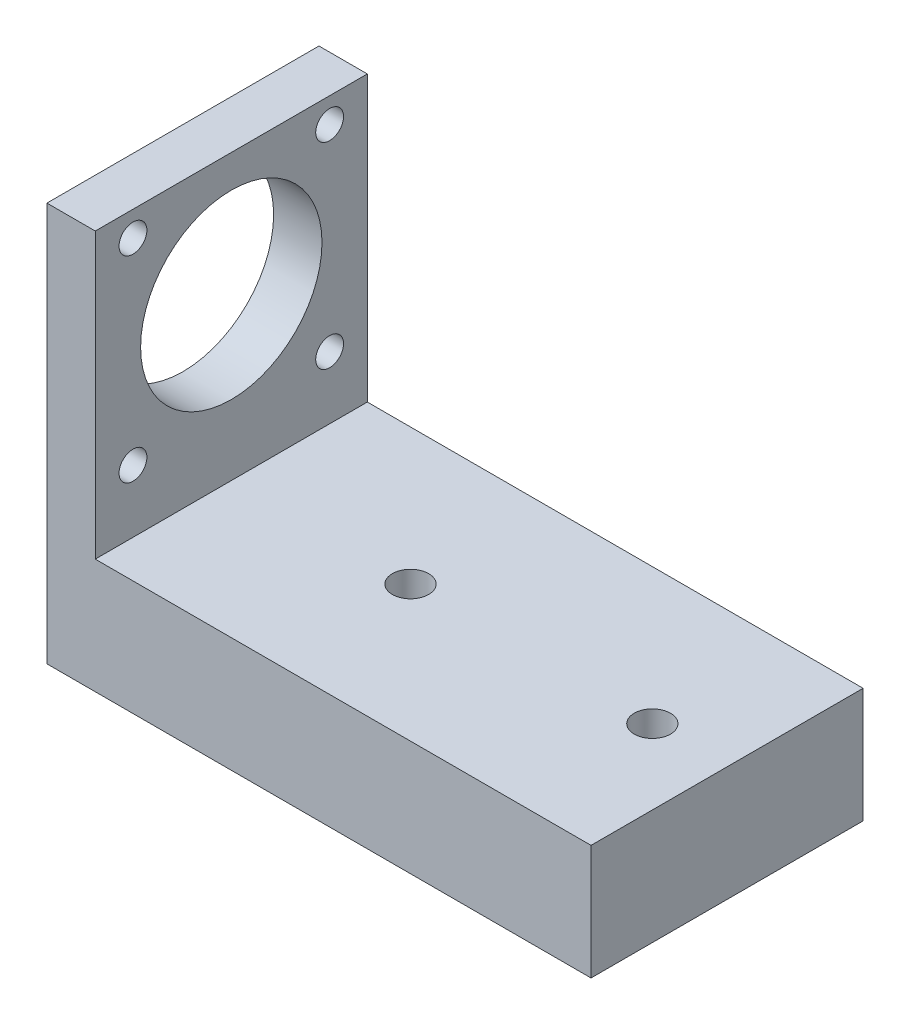
ISO-10303-21;
HEADER;
FILE_DESCRIPTION(('STEP AP214'),'2;1');
FILE_NAME('part.step','',(''),(''),'','','');
FILE_SCHEMA(('AUTOMOTIVE_DESIGN { 1 0 10303 214 1 1 1 1 }'));
ENDSEC;
DATA;
#1=APPLICATION_CONTEXT('core data for automotive mechanical design processes');
#2=APPLICATION_PROTOCOL_DEFINITION('international standard','automotive_design',2000,#1);
#3=PRODUCT_CONTEXT('',#1,'mechanical');
#4=PRODUCT('Part','Part','',(#3));
#5=PRODUCT_RELATED_PRODUCT_CATEGORY('part','',(#4));
#6=PRODUCT_DEFINITION_FORMATION('','',#4);
#7=PRODUCT_DEFINITION_CONTEXT('part definition',#1,'design');
#8=PRODUCT_DEFINITION('design','',#6,#7);
#9=PRODUCT_DEFINITION_SHAPE('','',#8);
#10=(LENGTH_UNIT() NAMED_UNIT(*) SI_UNIT(.MILLI.,.METRE.));
#11=(NAMED_UNIT(*) PLANE_ANGLE_UNIT() SI_UNIT($,.RADIAN.));
#12=(NAMED_UNIT(*) SI_UNIT($,.STERADIAN.) SOLID_ANGLE_UNIT());
#13=UNCERTAINTY_MEASURE_WITH_UNIT(LENGTH_MEASURE(1.E-05),#10,'distance_accuracy_value','');
#14=(GEOMETRIC_REPRESENTATION_CONTEXT(3) GLOBAL_UNCERTAINTY_ASSIGNED_CONTEXT((#13)) GLOBAL_UNIT_ASSIGNED_CONTEXT((#10,
#11,#12)) REPRESENTATION_CONTEXT('',''));
#15=CARTESIAN_POINT('',(0.,0.,0.));
#16=DIRECTION('',(0.,0.,1.));
#17=DIRECTION('',(1.,0.,0.));
#18=AXIS2_PLACEMENT_3D('',#15,#16,#17);
#19=CARTESIAN_POINT('',(-37.,66.,0.));
#20=DIRECTION('',(1.,0.,0.));
#21=DIRECTION('',(0.,0.,-1.));
#22=AXIS2_PLACEMENT_3D('',#19,#20,#21);
#23=PLANE('',#22);
#24=CARTESIAN_POINT('',(-37.,61.8634559672882,16.2634559672893));
#25=DIRECTION('',(1.,0.,0.));
#26=DIRECTION('',(0.,0.,-1.));
#27=AXIS2_PLACEMENT_3D('',#24,#25,#26);
#28=CIRCLE('',#27,2.3);
#29=CARTESIAN_POINT('',(-37.,61.8634559672882,13.9634559672893));
#30=VERTEX_POINT('',#29);
#31=EDGE_CURVE('E108',#30,#30,#28,.T.);
#32=ORIENTED_EDGE('',*,*,#31,.F.);
#33=EDGE_LOOP('',(#32));
#34=FACE_BOUND('',#33,.T.);
#35=CARTESIAN_POINT('',(-37.,29.336544032707,16.2634559672846));
#36=DIRECTION('',(1.,0.,0.));
#37=DIRECTION('',(0.,0.,-1.));
#38=AXIS2_PLACEMENT_3D('',#35,#36,#37);
#39=CIRCLE('',#38,2.3);
#40=CARTESIAN_POINT('',(-37.,29.336544032707,13.9634559672846));
#41=VERTEX_POINT('',#40);
#42=EDGE_CURVE('E158',#41,#41,#39,.T.);
#43=ORIENTED_EDGE('',*,*,#42,.F.);
#44=EDGE_LOOP('',(#43));
#45=FACE_BOUND('',#44,.T.);
#46=CARTESIAN_POINT('',(-37.,29.3365440327119,-16.2634559672967));
#47=DIRECTION('',(1.,0.,0.));
#48=DIRECTION('',(0.,0.,-1.));
#49=AXIS2_PLACEMENT_3D('',#46,#47,#48);
#50=CIRCLE('',#49,2.3);
#51=CARTESIAN_POINT('',(-37.,29.3365440327119,-18.5634559672966));
#52=VERTEX_POINT('',#51);
#53=EDGE_CURVE('E154',#52,#52,#50,.T.);
#54=ORIENTED_EDGE('',*,*,#53,.F.);
#55=EDGE_LOOP('',(#54));
#56=FACE_BOUND('',#55,.T.);
#57=CARTESIAN_POINT('',(-37.,61.8634559672931,-16.2634559672917));
#58=DIRECTION('',(1.,0.,0.));
#59=DIRECTION('',(0.,0.,-1.));
#60=AXIS2_PLACEMENT_3D('',#57,#58,#59);
#61=CIRCLE('',#60,2.3);
#62=CARTESIAN_POINT('',(-37.,61.8634559672931,-18.5634559672917));
#63=VERTEX_POINT('',#62);
#64=EDGE_CURVE('E150',#63,#63,#61,.T.);
#65=ORIENTED_EDGE('',*,*,#64,.F.);
#66=EDGE_LOOP('',(#65));
#67=FACE_BOUND('',#66,.T.);
#68=CARTESIAN_POINT('',(-37.,45.6,0.));
#69=DIRECTION('',(1.,0.,0.));
#70=DIRECTION('',(0.,0.,-1.));
#71=AXIS2_PLACEMENT_3D('',#68,#69,#70);
#72=CIRCLE('',#71,15.);
#73=CARTESIAN_POINT('',(-37.,45.6,-15.));
#74=VERTEX_POINT('',#73);
#75=EDGE_CURVE('E146',#74,#74,#72,.T.);
#76=ORIENTED_EDGE('',*,*,#75,.F.);
#77=EDGE_LOOP('',(#76));
#78=FACE_BOUND('',#77,.T.);
#79=DIRECTION('',(0.,-1.,0.));
#80=VECTOR('',#79,1.);
#81=CARTESIAN_POINT('',(-37.,66.,22.5));
#82=LINE('',#81,#80);
#83=CARTESIAN_POINT('',(-37.,66.,22.5));
#84=VERTEX_POINT('',#83);
#85=CARTESIAN_POINT('',(-37.,19.,22.5));
#86=VERTEX_POINT('',#85);
#87=EDGE_CURVE('E127',#84,#86,#82,.T.);
#88=ORIENTED_EDGE('',*,*,#87,.T.);
#89=DIRECTION('',(0.,0.,1.));
#90=VECTOR('',#89,1.);
#91=CARTESIAN_POINT('',(-37.,19.,-22.5));
#92=LINE('',#91,#90);
#93=CARTESIAN_POINT('',(-37.,19.,-22.5));
#94=VERTEX_POINT('',#93);
#95=EDGE_CURVE('E102',#94,#86,#92,.T.);
#96=ORIENTED_EDGE('',*,*,#95,.F.);
#97=DIRECTION('',(0.,-1.,0.));
#98=VECTOR('',#97,1.);
#99=CARTESIAN_POINT('',(-37.,66.,-22.5));
#100=LINE('',#99,#98);
#101=CARTESIAN_POINT('',(-37.,66.,-22.5));
#102=VERTEX_POINT('',#101);
#103=EDGE_CURVE('E101',#102,#94,#100,.T.);
#104=ORIENTED_EDGE('',*,*,#103,.F.);
#105=DIRECTION('',(0.,0.,1.));
#106=VECTOR('',#105,1.);
#107=CARTESIAN_POINT('',(-37.,66.,0.));
#108=LINE('',#107,#106);
#109=EDGE_CURVE('E117',#102,#84,#108,.T.);
#110=ORIENTED_EDGE('',*,*,#109,.T.);
#111=EDGE_LOOP('',(#88,#96,#104,#110));
#112=FACE_BOUND('',#111,.T.);
#113=ADVANCED_FACE('F37',(#34,#45,#56,#67,#78,#112),#23,.T.);
#114=CARTESIAN_POINT('',(45.,5.,-22.5));
#115=DIRECTION('',(-1.,0.,0.));
#116=DIRECTION('',(0.,0.,1.));
#117=AXIS2_PLACEMENT_3D('',#114,#115,#116);
#118=PLANE('',#117);
#119=DIRECTION('',(0.,0.,-1.));
#120=VECTOR('',#119,1.);
#121=CARTESIAN_POINT('',(45.,0.,-22.5));
#122=LINE('',#121,#120);
#123=CARTESIAN_POINT('',(45.,0.,22.5));
#124=VERTEX_POINT('',#123);
#125=CARTESIAN_POINT('',(45.,0.,-22.5));
#126=VERTEX_POINT('',#125);
#127=EDGE_CURVE('E96',#124,#126,#122,.T.);
#128=ORIENTED_EDGE('',*,*,#127,.T.);
#129=DIRECTION('',(0.,-1.,0.));
#130=VECTOR('',#129,1.);
#131=CARTESIAN_POINT('',(45.,5.,-22.5));
#132=LINE('',#131,#130);
#133=CARTESIAN_POINT('',(45.,19.,-22.5));
#134=VERTEX_POINT('',#133);
#135=EDGE_CURVE('E11',#134,#126,#132,.T.);
#136=ORIENTED_EDGE('',*,*,#135,.F.);
#137=DIRECTION('',(0.,0.,-1.));
#138=VECTOR('',#137,1.);
#139=CARTESIAN_POINT('',(45.,19.,-22.5));
#140=LINE('',#139,#138);
#141=CARTESIAN_POINT('',(45.,19.,22.5));
#142=VERTEX_POINT('',#141);
#143=EDGE_CURVE('E94',#142,#134,#140,.T.);
#144=ORIENTED_EDGE('',*,*,#143,.F.);
#145=DIRECTION('',(0.,-1.,0.));
#146=VECTOR('',#145,1.);
#147=CARTESIAN_POINT('',(45.,5.,22.5));
#148=LINE('',#147,#146);
#149=EDGE_CURVE('E137',#142,#124,#148,.T.);
#150=ORIENTED_EDGE('',*,*,#149,.T.);
#151=EDGE_LOOP('',(#128,#136,#144,#150));
#152=FACE_BOUND('',#151,.T.);
#153=ADVANCED_FACE('F39',(#152),#118,.F.);
#154=CARTESIAN_POINT('',(-45.,5.,-22.5));
#155=DIRECTION('',(0.,0.,1.));
#156=DIRECTION('',(1.,0.,0.));
#157=AXIS2_PLACEMENT_3D('',#154,#155,#156);
#158=PLANE('',#157);
#159=DIRECTION('',(-1.,0.,0.));
#160=VECTOR('',#159,1.);
#161=CARTESIAN_POINT('',(-45.,0.,-22.5));
#162=LINE('',#161,#160);
#163=CARTESIAN_POINT('',(-45.,0.,-22.5));
#164=VERTEX_POINT('',#163);
#165=EDGE_CURVE('E132',#126,#164,#162,.T.);
#166=ORIENTED_EDGE('',*,*,#165,.T.);
#167=DIRECTION('',(0.,-1.,0.));
#168=VECTOR('',#167,1.);
#169=CARTESIAN_POINT('',(-45.,5.,-22.5));
#170=LINE('',#169,#168);
#171=CARTESIAN_POINT('',(-45.,66.,-22.5));
#172=VERTEX_POINT('',#171);
#173=EDGE_CURVE('E46',#172,#164,#170,.T.);
#174=ORIENTED_EDGE('',*,*,#173,.F.);
#175=DIRECTION('',(1.,0.,0.));
#176=VECTOR('',#175,1.);
#177=CARTESIAN_POINT('',(0.,66.,-22.5));
#178=LINE('',#177,#176);
#179=EDGE_CURVE('E120',#172,#102,#178,.T.);
#180=ORIENTED_EDGE('',*,*,#179,.T.);
#181=ORIENTED_EDGE('',*,*,#103,.T.);
#182=DIRECTION('',(-1.,0.,0.));
#183=VECTOR('',#182,1.);
#184=CARTESIAN_POINT('',(45.,19.,-22.5));
#185=LINE('',#184,#183);
#186=EDGE_CURVE('E54',#134,#94,#185,.T.);
#187=ORIENTED_EDGE('',*,*,#186,.F.);
#188=ORIENTED_EDGE('',*,*,#135,.T.);
#189=EDGE_LOOP('',(#166,#174,#180,#181,#187,#188));
#190=FACE_BOUND('',#189,.T.);
#191=ADVANCED_FACE('F99',(#190),#158,.F.);
#192=CARTESIAN_POINT('',(-45.,5.,-22.5));
#193=DIRECTION('',(1.,0.,0.));
#194=DIRECTION('',(0.,0.,-1.));
#195=AXIS2_PLACEMENT_3D('',#192,#193,#194);
#196=PLANE('',#195);
#197=CARTESIAN_POINT('',(-45.,61.8634559672882,16.2634559672893));
#198=DIRECTION('',(1.,0.,0.));
#199=DIRECTION('',(0.,0.,-1.));
#200=AXIS2_PLACEMENT_3D('',#197,#198,#199);
#201=CIRCLE('',#200,2.3);
#202=CARTESIAN_POINT('',(-45.,61.8634559672882,13.9634559672893));
#203=VERTEX_POINT('',#202);
#204=EDGE_CURVE('E111',#203,#203,#201,.T.);
#205=ORIENTED_EDGE('',*,*,#204,.T.);
#206=EDGE_LOOP('',(#205));
#207=FACE_BOUND('',#206,.T.);
#208=CARTESIAN_POINT('',(-45.,29.336544032707,16.2634559672846));
#209=DIRECTION('',(1.,0.,0.));
#210=DIRECTION('',(0.,0.,-1.));
#211=AXIS2_PLACEMENT_3D('',#208,#209,#210);
#212=CIRCLE('',#211,2.3);
#213=CARTESIAN_POINT('',(-45.,29.336544032707,13.9634559672846));
#214=VERTEX_POINT('',#213);
#215=EDGE_CURVE('E155',#214,#214,#212,.T.);
#216=ORIENTED_EDGE('',*,*,#215,.T.);
#217=EDGE_LOOP('',(#216));
#218=FACE_BOUND('',#217,.T.);
#219=CARTESIAN_POINT('',(-45.,29.3365440327119,-16.2634559672967));
#220=DIRECTION('',(1.,0.,0.));
#221=DIRECTION('',(0.,0.,-1.));
#222=AXIS2_PLACEMENT_3D('',#219,#220,#221);
#223=CIRCLE('',#222,2.3);
#224=CARTESIAN_POINT('',(-45.,29.3365440327119,-18.5634559672966));
#225=VERTEX_POINT('',#224);
#226=EDGE_CURVE('E151',#225,#225,#223,.T.);
#227=ORIENTED_EDGE('',*,*,#226,.T.);
#228=EDGE_LOOP('',(#227));
#229=FACE_BOUND('',#228,.T.);
#230=CARTESIAN_POINT('',(-45.,61.8634559672931,-16.2634559672917));
#231=DIRECTION('',(1.,0.,0.));
#232=DIRECTION('',(0.,0.,-1.));
#233=AXIS2_PLACEMENT_3D('',#230,#231,#232);
#234=CIRCLE('',#233,2.3);
#235=CARTESIAN_POINT('',(-45.,61.8634559672931,-18.5634559672917));
#236=VERTEX_POINT('',#235);
#237=EDGE_CURVE('E147',#236,#236,#234,.T.);
#238=ORIENTED_EDGE('',*,*,#237,.T.);
#239=EDGE_LOOP('',(#238));
#240=FACE_BOUND('',#239,.T.);
#241=CARTESIAN_POINT('',(-45.,45.6,0.));
#242=DIRECTION('',(1.,0.,0.));
#243=DIRECTION('',(0.,0.,-1.));
#244=AXIS2_PLACEMENT_3D('',#241,#242,#243);
#245=CIRCLE('',#244,15.);
#246=CARTESIAN_POINT('',(-45.,45.6,-15.));
#247=VERTEX_POINT('',#246);
#248=EDGE_CURVE('E143',#247,#247,#245,.T.);
#249=ORIENTED_EDGE('',*,*,#248,.T.);
#250=EDGE_LOOP('',(#249));
#251=FACE_BOUND('',#250,.T.);
#252=DIRECTION('',(0.,0.,1.));
#253=VECTOR('',#252,1.);
#254=CARTESIAN_POINT('',(-45.,0.,-22.5));
#255=LINE('',#254,#253);
#256=CARTESIAN_POINT('',(-45.,0.,22.5));
#257=VERTEX_POINT('',#256);
#258=EDGE_CURVE('E134',#164,#257,#255,.T.);
#259=ORIENTED_EDGE('',*,*,#258,.T.);
#260=DIRECTION('',(0.,-1.,0.));
#261=VECTOR('',#260,1.);
#262=CARTESIAN_POINT('',(-45.,5.,22.5));
#263=LINE('',#262,#261);
#264=CARTESIAN_POINT('',(-45.,66.,22.5));
#265=VERTEX_POINT('',#264);
#266=EDGE_CURVE('E139',#265,#257,#263,.T.);
#267=ORIENTED_EDGE('',*,*,#266,.F.);
#268=DIRECTION('',(0.,0.,1.));
#269=VECTOR('',#268,1.);
#270=CARTESIAN_POINT('',(-45.,66.,0.));
#271=LINE('',#270,#269);
#272=EDGE_CURVE('E122',#172,#265,#271,.T.);
#273=ORIENTED_EDGE('',*,*,#272,.F.);
#274=ORIENTED_EDGE('',*,*,#173,.T.);
#275=EDGE_LOOP('',(#259,#267,#273,#274));
#276=FACE_BOUND('',#275,.T.);
#277=ADVANCED_FACE('F204',(#207,#218,#229,#240,#251,#276),#196,.F.);
#278=CARTESIAN_POINT('',(-45.,5.,22.5));
#279=DIRECTION('',(0.,0.,-1.));
#280=DIRECTION('',(-1.,0.,0.));
#281=AXIS2_PLACEMENT_3D('',#278,#279,#280);
#282=PLANE('',#281);
#283=DIRECTION('',(1.,0.,0.));
#284=VECTOR('',#283,1.);
#285=CARTESIAN_POINT('',(-45.,0.,22.5));
#286=LINE('',#285,#284);
#287=EDGE_CURVE('E62',#257,#124,#286,.T.);
#288=ORIENTED_EDGE('',*,*,#287,.T.);
#289=ORIENTED_EDGE('',*,*,#149,.F.);
#290=DIRECTION('',(1.,0.,0.));
#291=VECTOR('',#290,1.);
#292=CARTESIAN_POINT('',(45.,19.,22.5));
#293=LINE('',#292,#291);
#294=EDGE_CURVE('E107',#86,#142,#293,.T.);
#295=ORIENTED_EDGE('',*,*,#294,.F.);
#296=ORIENTED_EDGE('',*,*,#87,.F.);
#297=DIRECTION('',(1.,0.,0.));
#298=VECTOR('',#297,1.);
#299=CARTESIAN_POINT('',(0.,66.,22.5));
#300=LINE('',#299,#298);
#301=EDGE_CURVE('E125',#265,#84,#300,.T.);
#302=ORIENTED_EDGE('',*,*,#301,.F.);
#303=ORIENTED_EDGE('',*,*,#266,.T.);
#304=EDGE_LOOP('',(#288,#289,#295,#296,#302,#303));
#305=FACE_BOUND('',#304,.T.);
#306=ADVANCED_FACE('F198',(#305),#282,.F.);
#307=CARTESIAN_POINT('',(0.,0.,0.));
#308=DIRECTION('',(0.,1.,0.));
#309=DIRECTION('',(0.,0.,1.));
#310=AXIS2_PLACEMENT_3D('',#307,#308,#309);
#311=PLANE('',#310);
#312=CARTESIAN_POINT('',(32.641263942922,0.,0.));
#313=DIRECTION('',(0.,1.,0.));
#314=DIRECTION('',(0.,0.,1.));
#315=AXIS2_PLACEMENT_3D('',#312,#313,#314);
#316=CIRCLE('',#315,3.);
#317=CARTESIAN_POINT('',(32.641263942922,0.,3.));
#318=VERTEX_POINT('',#317);
#319=EDGE_CURVE('E162',#318,#318,#316,.T.);
#320=ORIENTED_EDGE('',*,*,#319,.T.);
#321=EDGE_LOOP('',(#320));
#322=FACE_BOUND('',#321,.T.);
#323=CARTESIAN_POINT('',(-7.35873605707796,0.,0.));
#324=DIRECTION('',(0.,1.,0.));
#325=DIRECTION('',(0.,0.,1.));
#326=AXIS2_PLACEMENT_3D('',#323,#324,#325);
#327=CIRCLE('',#326,3.);
#328=CARTESIAN_POINT('',(-7.35873605707796,0.,3.));
#329=VERTEX_POINT('',#328);
#330=EDGE_CURVE('E167',#329,#329,#327,.T.);
#331=ORIENTED_EDGE('',*,*,#330,.T.);
#332=EDGE_LOOP('',(#331));
#333=FACE_BOUND('',#332,.T.);
#334=ORIENTED_EDGE('',*,*,#127,.F.);
#335=ORIENTED_EDGE('',*,*,#287,.F.);
#336=ORIENTED_EDGE('',*,*,#258,.F.);
#337=ORIENTED_EDGE('',*,*,#165,.F.);
#338=EDGE_LOOP('',(#334,#335,#336,#337));
#339=FACE_BOUND('',#338,.T.);
#340=ADVANCED_FACE('F200',(#322,#333,#339),#311,.F.);
#341=CARTESIAN_POINT('',(0.,66.,0.));
#342=DIRECTION('',(0.,1.,0.));
#343=DIRECTION('',(0.,0.,1.));
#344=AXIS2_PLACEMENT_3D('',#341,#342,#343);
#345=PLANE('',#344);
#346=ORIENTED_EDGE('',*,*,#109,.F.);
#347=ORIENTED_EDGE('',*,*,#179,.F.);
#348=ORIENTED_EDGE('',*,*,#272,.T.);
#349=ORIENTED_EDGE('',*,*,#301,.T.);
#350=EDGE_LOOP('',(#346,#347,#348,#349));
#351=FACE_BOUND('',#350,.T.);
#352=ADVANCED_FACE('F207',(#351),#345,.T.);
#353=CARTESIAN_POINT('',(0.,19.,0.));
#354=DIRECTION('',(0.,-1.,0.));
#355=DIRECTION('',(0.,0.,-1.));
#356=AXIS2_PLACEMENT_3D('',#353,#354,#355);
#357=PLANE('',#356);
#358=CARTESIAN_POINT('',(32.641263942922,19.,0.));
#359=DIRECTION('',(0.,-1.,0.));
#360=DIRECTION('',(0.,0.,-1.));
#361=AXIS2_PLACEMENT_3D('',#358,#359,#360);
#362=CIRCLE('',#361,3.);
#363=CARTESIAN_POINT('',(32.641263942922,19.,-3.));
#364=VERTEX_POINT('',#363);
#365=EDGE_CURVE('E41',#364,#364,#362,.F.);
#366=ORIENTED_EDGE('',*,*,#365,.F.);
#367=EDGE_LOOP('',(#366));
#368=FACE_BOUND('',#367,.T.);
#369=CARTESIAN_POINT('',(-7.35873605707796,19.,0.));
#370=DIRECTION('',(0.,-1.,0.));
#371=DIRECTION('',(0.,0.,-1.));
#372=AXIS2_PLACEMENT_3D('',#369,#370,#371);
#373=CIRCLE('',#372,3.);
#374=CARTESIAN_POINT('',(-7.35873605707796,19.,-3.));
#375=VERTEX_POINT('',#374);
#376=EDGE_CURVE('E160',#375,#375,#373,.F.);
#377=ORIENTED_EDGE('',*,*,#376,.F.);
#378=EDGE_LOOP('',(#377));
#379=FACE_BOUND('',#378,.T.);
#380=ORIENTED_EDGE('',*,*,#143,.T.);
#381=ORIENTED_EDGE('',*,*,#186,.T.);
#382=ORIENTED_EDGE('',*,*,#95,.T.);
#383=ORIENTED_EDGE('',*,*,#294,.T.);
#384=EDGE_LOOP('',(#380,#381,#382,#383));
#385=FACE_BOUND('',#384,.T.);
#386=ADVANCED_FACE('F105',(#368,#379,#385),#357,.F.);
#387=CARTESIAN_POINT('',(-55.,45.6,0.));
#388=DIRECTION('',(1.,0.,0.));
#389=DIRECTION('',(0.,0.,-1.));
#390=AXIS2_PLACEMENT_3D('',#387,#388,#389);
#391=CYLINDRICAL_SURFACE('',#390,15.);
#392=ORIENTED_EDGE('',*,*,#75,.T.);
#393=EDGE_LOOP('',(#392));
#394=FACE_BOUND('',#393,.T.);
#395=ORIENTED_EDGE('',*,*,#248,.F.);
#396=EDGE_LOOP('',(#395));
#397=FACE_BOUND('',#396,.T.);
#398=ADVANCED_FACE('F214',(#394,#397),#391,.F.);
#399=CARTESIAN_POINT('',(-55.,61.8634559672931,-16.2634559672917));
#400=DIRECTION('',(1.,0.,0.));
#401=DIRECTION('',(0.,0.,-1.));
#402=AXIS2_PLACEMENT_3D('',#399,#400,#401);
#403=CYLINDRICAL_SURFACE('',#402,2.3);
#404=ORIENTED_EDGE('',*,*,#64,.T.);
#405=EDGE_LOOP('',(#404));
#406=FACE_BOUND('',#405,.T.);
#407=ORIENTED_EDGE('',*,*,#237,.F.);
#408=EDGE_LOOP('',(#407));
#409=FACE_BOUND('',#408,.T.);
#410=ADVANCED_FACE('F256',(#406,#409),#403,.F.);
#411=CARTESIAN_POINT('',(-55.,29.3365440327119,-16.2634559672967));
#412=DIRECTION('',(1.,0.,0.));
#413=DIRECTION('',(0.,0.,-1.));
#414=AXIS2_PLACEMENT_3D('',#411,#412,#413);
#415=CYLINDRICAL_SURFACE('',#414,2.3);
#416=ORIENTED_EDGE('',*,*,#53,.T.);
#417=EDGE_LOOP('',(#416));
#418=FACE_BOUND('',#417,.T.);
#419=ORIENTED_EDGE('',*,*,#226,.F.);
#420=EDGE_LOOP('',(#419));
#421=FACE_BOUND('',#420,.T.);
#422=ADVANCED_FACE('F266',(#418,#421),#415,.F.);
#423=CARTESIAN_POINT('',(-55.,29.336544032707,16.2634559672846));
#424=DIRECTION('',(1.,0.,0.));
#425=DIRECTION('',(0.,0.,-1.));
#426=AXIS2_PLACEMENT_3D('',#423,#424,#425);
#427=CYLINDRICAL_SURFACE('',#426,2.3);
#428=ORIENTED_EDGE('',*,*,#42,.T.);
#429=EDGE_LOOP('',(#428));
#430=FACE_BOUND('',#429,.T.);
#431=ORIENTED_EDGE('',*,*,#215,.F.);
#432=EDGE_LOOP('',(#431));
#433=FACE_BOUND('',#432,.T.);
#434=ADVANCED_FACE('F182',(#430,#433),#427,.F.);
#435=CARTESIAN_POINT('',(-55.,61.8634559672882,16.2634559672893));
#436=DIRECTION('',(1.,0.,0.));
#437=DIRECTION('',(0.,0.,-1.));
#438=AXIS2_PLACEMENT_3D('',#435,#436,#437);
#439=CYLINDRICAL_SURFACE('',#438,2.3);
#440=ORIENTED_EDGE('',*,*,#31,.T.);
#441=EDGE_LOOP('',(#440));
#442=FACE_BOUND('',#441,.T.);
#443=ORIENTED_EDGE('',*,*,#204,.F.);
#444=EDGE_LOOP('',(#443));
#445=FACE_BOUND('',#444,.T.);
#446=ADVANCED_FACE('F285',(#442,#445),#439,.F.);
#447=CARTESIAN_POINT('',(-7.35873605707796,55.,0.));
#448=DIRECTION('',(0.,-1.,0.));
#449=DIRECTION('',(0.,0.,-1.));
#450=AXIS2_PLACEMENT_3D('',#447,#448,#449);
#451=CYLINDRICAL_SURFACE('',#450,3.);
#452=ORIENTED_EDGE('',*,*,#330,.F.);
#453=EDGE_LOOP('',(#452));
#454=FACE_BOUND('',#453,.T.);
#455=ORIENTED_EDGE('',*,*,#376,.T.);
#456=EDGE_LOOP('',(#455));
#457=FACE_BOUND('',#456,.T.);
#458=ADVANCED_FACE('F294',(#454,#457),#451,.F.);
#459=CARTESIAN_POINT('',(32.641263942922,55.,0.));
#460=DIRECTION('',(0.,-1.,0.));
#461=DIRECTION('',(0.,0.,-1.));
#462=AXIS2_PLACEMENT_3D('',#459,#460,#461);
#463=CYLINDRICAL_SURFACE('',#462,3.);
#464=ORIENTED_EDGE('',*,*,#319,.F.);
#465=EDGE_LOOP('',(#464));
#466=FACE_BOUND('',#465,.T.);
#467=ORIENTED_EDGE('',*,*,#365,.T.);
#468=EDGE_LOOP('',(#467));
#469=FACE_BOUND('',#468,.T.);
#470=ADVANCED_FACE('F316',(#466,#469),#463,.F.);
#471=CLOSED_SHELL('',(#113,#153,#191,#277,#306,#340,#352,#386,#398,#410,#422,#434,#446,#458,#470));
#472=MANIFOLD_SOLID_BREP('B2',#471);
#473=ADVANCED_BREP_SHAPE_REPRESENTATION('',(#18,#472),#14);
#474=SHAPE_DEFINITION_REPRESENTATION(#9,#473);
ENDSEC;
END-ISO-10303-21;
